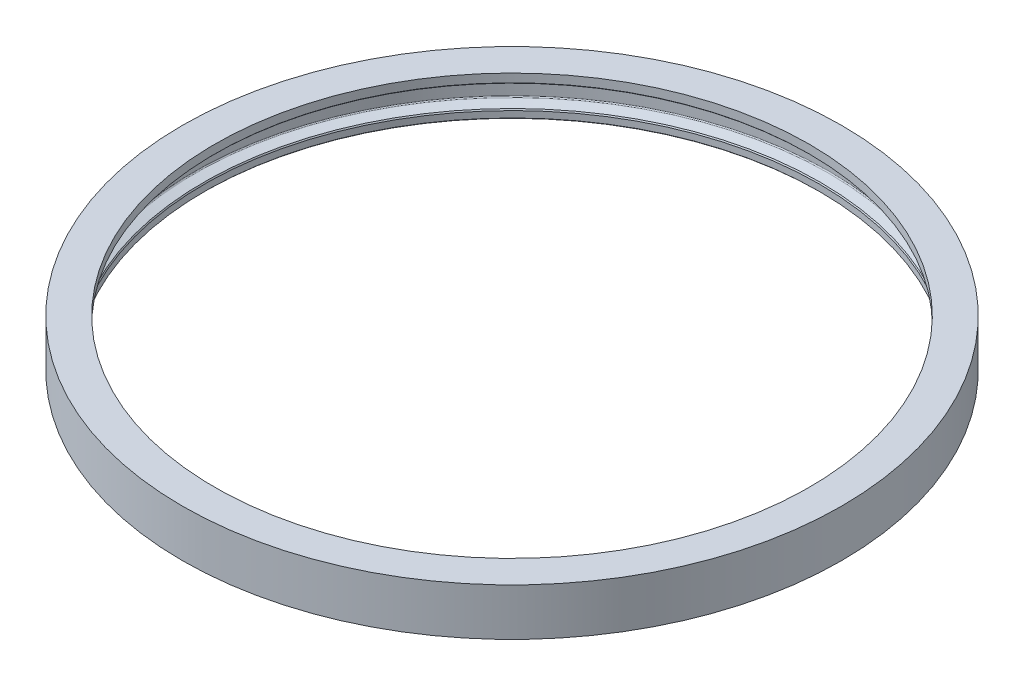
ISO-10303-21;
HEADER;
FILE_DESCRIPTION(('STEP AP214'),'2;1');
FILE_NAME('part.step','',(''),(''),'','','');
FILE_SCHEMA(('AUTOMOTIVE_DESIGN { 1 0 10303 214 1 1 1 1 }'));
ENDSEC;
DATA;
#1=APPLICATION_CONTEXT('core data for automotive mechanical design processes');
#2=APPLICATION_PROTOCOL_DEFINITION('international standard','automotive_design',2000,#1);
#3=PRODUCT_CONTEXT('',#1,'mechanical');
#4=PRODUCT('Part','Part','',(#3));
#5=PRODUCT_RELATED_PRODUCT_CATEGORY('part','',(#4));
#6=PRODUCT_DEFINITION_FORMATION('','',#4);
#7=PRODUCT_DEFINITION_CONTEXT('part definition',#1,'design');
#8=PRODUCT_DEFINITION('design','',#6,#7);
#9=PRODUCT_DEFINITION_SHAPE('','',#8);
#10=(LENGTH_UNIT() NAMED_UNIT(*) SI_UNIT(.MILLI.,.METRE.));
#11=(NAMED_UNIT(*) PLANE_ANGLE_UNIT() SI_UNIT($,.RADIAN.));
#12=(NAMED_UNIT(*) SI_UNIT($,.STERADIAN.) SOLID_ANGLE_UNIT());
#13=UNCERTAINTY_MEASURE_WITH_UNIT(LENGTH_MEASURE(1.E-05),#10,'distance_accuracy_value','');
#14=(GEOMETRIC_REPRESENTATION_CONTEXT(3) GLOBAL_UNCERTAINTY_ASSIGNED_CONTEXT((#13)) GLOBAL_UNIT_ASSIGNED_CONTEXT((#10,
#11,#12)) REPRESENTATION_CONTEXT('',''));
#15=CARTESIAN_POINT('',(0.,0.,0.));
#16=DIRECTION('',(0.,0.,1.));
#17=DIRECTION('',(1.,0.,0.));
#18=AXIS2_PLACEMENT_3D('',#15,#16,#17);
#19=CARTESIAN_POINT('',(0.,6.00485994212044,-83.82));
#20=DIRECTION('',(0.,-1.,0.));
#21=DIRECTION('',(0.,0.,-1.));
#22=AXIS2_PLACEMENT_3D('',#19,#20,#21);
#23=CYLINDRICAL_SURFACE('',#22,75.565);
#24=CARTESIAN_POINT('',(0.,12.0097198842409,-83.82));
#25=DIRECTION('',(0.,-1.,0.));
#26=DIRECTION('',(0.,0.,-1.));
#27=AXIS2_PLACEMENT_3D('',#24,#25,#26);
#28=CIRCLE('',#27,75.565);
#29=CARTESIAN_POINT('',(0.,12.0097198842409,-159.385));
#30=VERTEX_POINT('',#29);
#31=EDGE_CURVE('E74',#30,#30,#28,.T.);
#32=ORIENTED_EDGE('',*,*,#31,.F.);
#33=EDGE_LOOP('',(#32));
#34=FACE_BOUND('',#33,.T.);
#35=CARTESIAN_POINT('',(0.,9.85591988424095,-83.82));
#36=DIRECTION('',(0.,-1.,0.));
#37=DIRECTION('',(0.,0.,-1.));
#38=AXIS2_PLACEMENT_3D('',#35,#36,#37);
#39=CIRCLE('',#38,75.565);
#40=CARTESIAN_POINT('',(0.,9.85591988424095,-159.385));
#41=VERTEX_POINT('',#40);
#42=EDGE_CURVE('E10',#41,#41,#39,.T.);
#43=ORIENTED_EDGE('',*,*,#42,.T.);
#44=EDGE_LOOP('',(#43));
#45=FACE_BOUND('',#44,.T.);
#46=ADVANCED_FACE('F31',(#34,#45),#23,.F.);
#47=CARTESIAN_POINT('',(0.,9.60191988424091,-83.82));
#48=DIRECTION('',(0.,-1.,0.));
#49=DIRECTION('',(0.,0.,-1.));
#50=AXIS2_PLACEMENT_3D('',#47,#48,#49);
#51=CONICAL_SURFACE('',#50,75.819,0.785398163397455);
#52=ORIENTED_EDGE('',*,*,#42,.F.);
#53=EDGE_LOOP('',(#52));
#54=FACE_BOUND('',#53,.T.);
#55=CARTESIAN_POINT('',(0.,9.60191988424091,-83.82));
#56=DIRECTION('',(0.,-1.,0.));
#57=DIRECTION('',(0.,0.,-1.));
#58=AXIS2_PLACEMENT_3D('',#55,#56,#57);
#59=CIRCLE('',#58,75.819);
#60=CARTESIAN_POINT('',(0.,9.60191988424091,-159.639));
#61=VERTEX_POINT('',#60);
#62=EDGE_CURVE('E37',#61,#61,#59,.T.);
#63=ORIENTED_EDGE('',*,*,#62,.T.);
#64=EDGE_LOOP('',(#63));
#65=FACE_BOUND('',#64,.T.);
#66=ADVANCED_FACE('F81',(#54,#65),#51,.F.);
#67=CARTESIAN_POINT('',(0.,9.60191988424091,-8.00099999999997));
#68=DIRECTION('',(0.,1.,0.));
#69=DIRECTION('',(0.,0.,1.));
#70=AXIS2_PLACEMENT_3D('',#67,#68,#69);
#71=PLANE('',#70);
#72=ORIENTED_EDGE('',*,*,#62,.F.);
#73=EDGE_LOOP('',(#72));
#74=FACE_BOUND('',#73,.T.);
#75=CARTESIAN_POINT('',(0.,9.60191988424091,-83.82));
#76=DIRECTION('',(0.,-1.,0.));
#77=DIRECTION('',(0.,0.,-1.));
#78=AXIS2_PLACEMENT_3D('',#75,#76,#77);
#79=CIRCLE('',#78,80.5025);
#80=CARTESIAN_POINT('',(0.,9.60191988424091,-164.3225));
#81=VERTEX_POINT('',#80);
#82=EDGE_CURVE('E41',#81,#81,#79,.T.);
#83=ORIENTED_EDGE('',*,*,#82,.T.);
#84=EDGE_LOOP('',(#83));
#85=FACE_BOUND('',#84,.T.);
#86=ADVANCED_FACE('F85',(#74,#85),#71,.F.);
#87=CARTESIAN_POINT('',(0.,9.28441988424094,-83.82));
#88=DIRECTION('',(0.,-1.,0.));
#89=DIRECTION('',(0.,0.,-1.));
#90=AXIS2_PLACEMENT_3D('',#87,#88,#89);
#91=TOROIDAL_SURFACE('',#90,80.5025000000001,0.317499999999951);
#92=ORIENTED_EDGE('',*,*,#82,.F.);
#93=EDGE_LOOP('',(#92));
#94=FACE_BOUND('',#93,.T.);
#95=CARTESIAN_POINT('',(0.,9.28441988424089,-83.82));
#96=DIRECTION('',(0.,-1.,0.));
#97=DIRECTION('',(0.,0.,-1.));
#98=AXIS2_PLACEMENT_3D('',#95,#96,#97);
#99=CIRCLE('',#98,80.82);
#100=CARTESIAN_POINT('',(0.,9.28441988424089,-164.64));
#101=VERTEX_POINT('',#100);
#102=EDGE_CURVE('E45',#101,#101,#99,.T.);
#103=ORIENTED_EDGE('',*,*,#102,.T.);
#104=EDGE_LOOP('',(#103));
#105=FACE_BOUND('',#104,.T.);
#106=ADVANCED_FACE('F90',(#94,#105),#91,.F.);
#107=CARTESIAN_POINT('',(0.,6.00485994212044,-83.82));
#108=DIRECTION('',(0.,-1.,0.));
#109=DIRECTION('',(0.,0.,-1.));
#110=AXIS2_PLACEMENT_3D('',#107,#108,#109);
#111=CYLINDRICAL_SURFACE('',#110,80.82);
#112=ORIENTED_EDGE('',*,*,#102,.F.);
#113=EDGE_LOOP('',(#112));
#114=FACE_BOUND('',#113,.T.);
#115=CARTESIAN_POINT('',(0.,3.32423577762257,-83.82));
#116=DIRECTION('',(0.,-1.,0.));
#117=DIRECTION('',(0.,0.,-1.));
#118=AXIS2_PLACEMENT_3D('',#115,#116,#117);
#119=CIRCLE('',#118,80.82);
#120=CARTESIAN_POINT('',(0.,3.32423577762257,-164.64));
#121=VERTEX_POINT('',#120);
#122=EDGE_CURVE('E50',#121,#121,#119,.T.);
#123=ORIENTED_EDGE('',*,*,#122,.T.);
#124=EDGE_LOOP('',(#123));
#125=FACE_BOUND('',#124,.T.);
#126=ADVANCED_FACE('F96',(#114,#125),#111,.F.);
#127=CARTESIAN_POINT('',(0.,3.32423577762252,-83.82));
#128=DIRECTION('',(0.,-1.,0.));
#129=DIRECTION('',(0.,0.,-1.));
#130=AXIS2_PLACEMENT_3D('',#127,#128,#129);
#131=TOROIDAL_SURFACE('',#130,80.5025,0.317500000000022);
#132=ORIENTED_EDGE('',*,*,#122,.F.);
#133=EDGE_LOOP('',(#132));
#134=FACE_BOUND('',#133,.T.);
#135=CARTESIAN_POINT('',(0.,3.02588337052299,-83.82));
#136=DIRECTION('',(0.,-1.,0.));
#137=DIRECTION('',(0.,0.,-1.));
#138=AXIS2_PLACEMENT_3D('',#135,#136,#137);
#139=CIRCLE('',#138,80.6110913955059);
#140=CARTESIAN_POINT('',(0.,3.02588337052299,-164.431091395506));
#141=VERTEX_POINT('',#140);
#142=EDGE_CURVE('E53',#141,#141,#139,.T.);
#143=ORIENTED_EDGE('',*,*,#142,.T.);
#144=EDGE_LOOP('',(#143));
#145=FACE_BOUND('',#144,.T.);
#146=ADVANCED_FACE('F100',(#134,#145),#131,.F.);
#147=CARTESIAN_POINT('',(0.,2.21316338225868,-83.82));
#148=DIRECTION('',(0.,1.,0.));
#149=DIRECTION('',(0.,0.,1.));
#150=AXIS2_PLACEMENT_3D('',#147,#148,#149);
#151=CONICAL_SURFACE('',#150,78.3781615794103,1.22173047639602);
#152=ORIENTED_EDGE('',*,*,#142,.F.);
#153=EDGE_LOOP('',(#152));
#154=FACE_BOUND('',#153,.T.);
#155=CARTESIAN_POINT('',(0.,2.21316338225868,-83.82));
#156=DIRECTION('',(0.,-1.,0.));
#157=DIRECTION('',(0.,0.,-1.));
#158=AXIS2_PLACEMENT_3D('',#155,#156,#157);
#159=CIRCLE('',#158,78.3781615794103);
#160=CARTESIAN_POINT('',(0.,2.21316338225868,-162.19816157941));
#161=VERTEX_POINT('',#160);
#162=EDGE_CURVE('E56',#161,#161,#159,.T.);
#163=ORIENTED_EDGE('',*,*,#162,.T.);
#164=EDGE_LOOP('',(#163));
#165=FACE_BOUND('',#164,.T.);
#166=ADVANCED_FACE('F104',(#154,#165),#151,.F.);
#167=CARTESIAN_POINT('',(0.,1.89158809370649,-83.82));
#168=DIRECTION('',(0.,1.,0.));
#169=DIRECTION('',(0.,0.,1.));
#170=AXIS2_PLACEMENT_3D('',#167,#168,#169);
#171=CONICAL_SURFACE('',#170,78.1925,0.523598775598352);
#172=ORIENTED_EDGE('',*,*,#162,.F.);
#173=EDGE_LOOP('',(#172));
#174=FACE_BOUND('',#173,.T.);
#175=CARTESIAN_POINT('',(0.,1.89158809370649,-83.82));
#176=DIRECTION('',(0.,-1.,0.));
#177=DIRECTION('',(0.,0.,-1.));
#178=AXIS2_PLACEMENT_3D('',#175,#176,#177);
#179=CIRCLE('',#178,78.1925);
#180=CARTESIAN_POINT('',(0.,1.89158809370649,-162.0125));
#181=VERTEX_POINT('',#180);
#182=EDGE_CURVE('E59',#181,#181,#179,.T.);
#183=ORIENTED_EDGE('',*,*,#182,.T.);
#184=EDGE_LOOP('',(#183));
#185=FACE_BOUND('',#184,.T.);
#186=ADVANCED_FACE('F108',(#174,#185),#171,.F.);
#187=CARTESIAN_POINT('',(0.,6.00485994212044,-83.82));
#188=DIRECTION('',(0.,-1.,0.));
#189=DIRECTION('',(0.,0.,-1.));
#190=AXIS2_PLACEMENT_3D('',#187,#188,#189);
#191=CYLINDRICAL_SURFACE('',#190,78.1925);
#192=ORIENTED_EDGE('',*,*,#182,.F.);
#193=EDGE_LOOP('',(#192));
#194=FACE_BOUND('',#193,.T.);
#195=CARTESIAN_POINT('',(0.,0.253999999999976,-83.82));
#196=DIRECTION('',(0.,-1.,0.));
#197=DIRECTION('',(0.,0.,-1.));
#198=AXIS2_PLACEMENT_3D('',#195,#196,#197);
#199=CIRCLE('',#198,78.1925);
#200=CARTESIAN_POINT('',(0.,0.253999999999976,-162.0125));
#201=VERTEX_POINT('',#200);
#202=EDGE_CURVE('E62',#201,#201,#199,.T.);
#203=ORIENTED_EDGE('',*,*,#202,.T.);
#204=EDGE_LOOP('',(#203));
#205=FACE_BOUND('',#204,.T.);
#206=ADVANCED_FACE('F112',(#194,#205),#191,.F.);
#207=CARTESIAN_POINT('',(0.,0.,-83.82));
#208=DIRECTION('',(0.,-1.,0.));
#209=DIRECTION('',(0.,0.,-1.));
#210=AXIS2_PLACEMENT_3D('',#207,#208,#209);
#211=CONICAL_SURFACE('',#210,78.4465,0.78539816339746);
#212=ORIENTED_EDGE('',*,*,#202,.F.);
#213=EDGE_LOOP('',(#212));
#214=FACE_BOUND('',#213,.T.);
#215=CARTESIAN_POINT('',(0.,0.,-83.82));
#216=DIRECTION('',(0.,-1.,0.));
#217=DIRECTION('',(0.,0.,-1.));
#218=AXIS2_PLACEMENT_3D('',#215,#216,#217);
#219=CIRCLE('',#218,78.4465);
#220=CARTESIAN_POINT('',(0.,0.,-162.2665));
#221=VERTEX_POINT('',#220);
#222=EDGE_CURVE('E65',#221,#221,#219,.T.);
#223=ORIENTED_EDGE('',*,*,#222,.T.);
#224=EDGE_LOOP('',(#223));
#225=FACE_BOUND('',#224,.T.);
#226=ADVANCED_FACE('F116',(#214,#225),#211,.F.);
#227=CARTESIAN_POINT('',(0.,0.,-5.37350000000002));
#228=DIRECTION('',(0.,1.,0.));
#229=DIRECTION('',(0.,0.,1.));
#230=AXIS2_PLACEMENT_3D('',#227,#228,#229);
#231=PLANE('',#230);
#232=ORIENTED_EDGE('',*,*,#222,.F.);
#233=EDGE_LOOP('',(#232));
#234=FACE_BOUND('',#233,.T.);
#235=CARTESIAN_POINT('',(0.,0.,-83.82));
#236=DIRECTION('',(0.,-1.,0.));
#237=DIRECTION('',(0.,0.,-1.));
#238=AXIS2_PLACEMENT_3D('',#235,#236,#237);
#239=CIRCLE('',#238,83.82);
#240=CARTESIAN_POINT('',(0.,0.,-167.64));
#241=VERTEX_POINT('',#240);
#242=EDGE_CURVE('E68',#241,#241,#239,.T.);
#243=ORIENTED_EDGE('',*,*,#242,.T.);
#244=EDGE_LOOP('',(#243));
#245=FACE_BOUND('',#244,.T.);
#246=ADVANCED_FACE('F120',(#234,#245),#231,.F.);
#247=CARTESIAN_POINT('',(0.,6.00485994212044,-83.82));
#248=DIRECTION('',(0.,-1.,0.));
#249=DIRECTION('',(0.,0.,-1.));
#250=AXIS2_PLACEMENT_3D('',#247,#248,#249);
#251=CYLINDRICAL_SURFACE('',#250,83.82);
#252=ORIENTED_EDGE('',*,*,#242,.F.);
#253=EDGE_LOOP('',(#252));
#254=FACE_BOUND('',#253,.T.);
#255=CARTESIAN_POINT('',(0.,12.0097198842409,-83.82));
#256=DIRECTION('',(0.,-1.,0.));
#257=DIRECTION('',(0.,0.,-1.));
#258=AXIS2_PLACEMENT_3D('',#255,#256,#257);
#259=CIRCLE('',#258,83.82);
#260=CARTESIAN_POINT('',(0.,12.0097198842409,-167.64));
#261=VERTEX_POINT('',#260);
#262=EDGE_CURVE('E71',#261,#261,#259,.T.);
#263=ORIENTED_EDGE('',*,*,#262,.T.);
#264=EDGE_LOOP('',(#263));
#265=FACE_BOUND('',#264,.T.);
#266=ADVANCED_FACE('F124',(#254,#265),#251,.T.);
#267=CARTESIAN_POINT('',(0.,12.0097198842409,0.));
#268=DIRECTION('',(0.,-1.,0.));
#269=DIRECTION('',(0.,0.,-1.));
#270=AXIS2_PLACEMENT_3D('',#267,#268,#269);
#271=PLANE('',#270);
#272=ORIENTED_EDGE('',*,*,#262,.F.);
#273=EDGE_LOOP('',(#272));
#274=FACE_BOUND('',#273,.T.);
#275=ORIENTED_EDGE('',*,*,#31,.T.);
#276=EDGE_LOOP('',(#275));
#277=FACE_BOUND('',#276,.T.);
#278=ADVANCED_FACE('F78',(#274,#277),#271,.F.);
#279=CLOSED_SHELL('',(#46,#66,#86,#106,#126,#146,#166,#186,#206,#226,#246,#266,#278));
#280=MANIFOLD_SOLID_BREP('B2',#279);
#281=ADVANCED_BREP_SHAPE_REPRESENTATION('',(#18,#280),#14);
#282=SHAPE_DEFINITION_REPRESENTATION(#9,#281);
ENDSEC;
END-ISO-10303-21;
